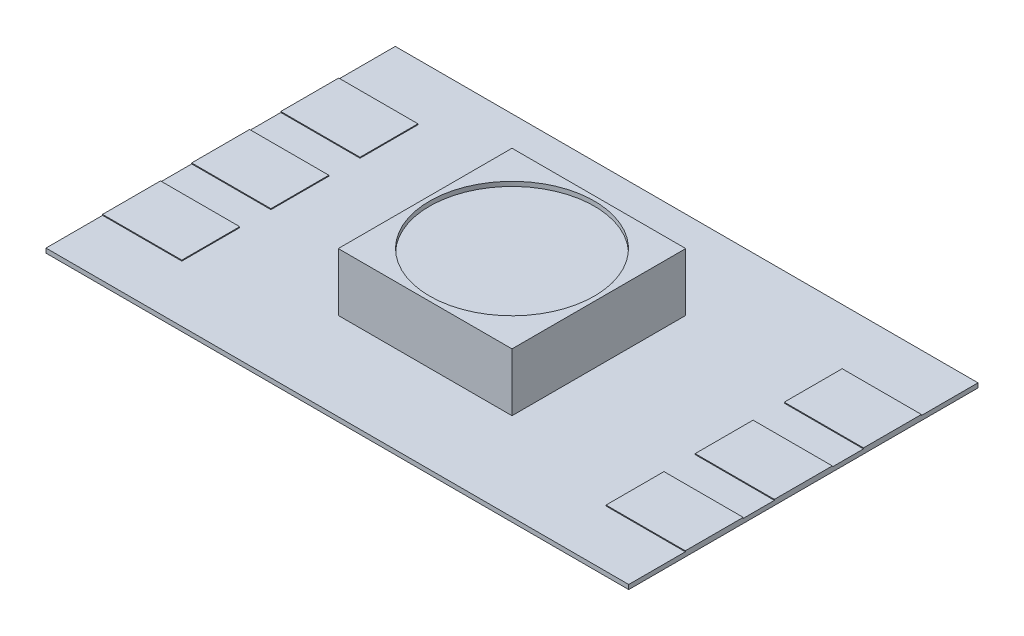
ISO-10303-21;
HEADER;
FILE_DESCRIPTION(('STEP AP214'),'2;1');
FILE_NAME('part.step','',(''),(''),'','','');
FILE_SCHEMA(('AUTOMOTIVE_DESIGN { 1 0 10303 214 1 1 1 1 }'));
ENDSEC;
DATA;
#1=APPLICATION_CONTEXT('core data for automotive mechanical design processes');
#2=APPLICATION_PROTOCOL_DEFINITION('international standard','automotive_design',2000,#1);
#3=PRODUCT_CONTEXT('',#1,'mechanical');
#4=PRODUCT('Part','Part','',(#3));
#5=PRODUCT_RELATED_PRODUCT_CATEGORY('part','',(#4));
#6=PRODUCT_DEFINITION_FORMATION('','',#4);
#7=PRODUCT_DEFINITION_CONTEXT('part definition',#1,'design');
#8=PRODUCT_DEFINITION('design','',#6,#7);
#9=PRODUCT_DEFINITION_SHAPE('','',#8);
#10=(LENGTH_UNIT() NAMED_UNIT(*) SI_UNIT(.MILLI.,.METRE.));
#11=(NAMED_UNIT(*) PLANE_ANGLE_UNIT() SI_UNIT($,.RADIAN.));
#12=(NAMED_UNIT(*) SI_UNIT($,.STERADIAN.) SOLID_ANGLE_UNIT());
#13=UNCERTAINTY_MEASURE_WITH_UNIT(LENGTH_MEASURE(1.E-05),#10,'distance_accuracy_value','');
#14=(GEOMETRIC_REPRESENTATION_CONTEXT(3) GLOBAL_UNCERTAINTY_ASSIGNED_CONTEXT((#13)) GLOBAL_UNIT_ASSIGNED_CONTEXT((#10,
#11,#12)) REPRESENTATION_CONTEXT('',''));
#15=CARTESIAN_POINT('',(0.,0.,0.));
#16=DIRECTION('',(0.,0.,1.));
#17=DIRECTION('',(1.,0.,0.));
#18=AXIS2_PLACEMENT_3D('',#15,#16,#17);
#19=CARTESIAN_POINT('',(0.,0.127,0.));
#20=DIRECTION('',(0.,1.,0.));
#21=DIRECTION('',(0.,0.,1.));
#22=AXIS2_PLACEMENT_3D('',#19,#20,#21);
#23=PLANE('',#22);
#24=DIRECTION('',(1.,0.,0.));
#25=VECTOR('',#24,1.);
#26=CARTESIAN_POINT('',(-2.4765,0.127,2.4765));
#27=LINE('',#26,#25);
#28=CARTESIAN_POINT('',(-2.4765,0.127,2.4765));
#29=VERTEX_POINT('',#28);
#30=CARTESIAN_POINT('',(2.4765,0.127,2.4765));
#31=VERTEX_POINT('',#30);
#32=EDGE_CURVE('E432',#29,#31,#27,.T.);
#33=ORIENTED_EDGE('',*,*,#32,.F.);
#34=DIRECTION('',(0.,0.,1.));
#35=VECTOR('',#34,1.);
#36=CARTESIAN_POINT('',(-2.4765,0.127,-2.4765));
#37=LINE('',#36,#35);
#38=CARTESIAN_POINT('',(-2.4765,0.127,-2.4765));
#39=VERTEX_POINT('',#38);
#40=EDGE_CURVE('E418',#39,#29,#37,.T.);
#41=ORIENTED_EDGE('',*,*,#40,.F.);
#42=DIRECTION('',(-1.,0.,0.));
#43=VECTOR('',#42,1.);
#44=CARTESIAN_POINT('',(-2.4765,0.127,-2.4765));
#45=LINE('',#44,#43);
#46=CARTESIAN_POINT('',(2.4765,0.127,-2.4765));
#47=VERTEX_POINT('',#46);
#48=EDGE_CURVE('E423',#47,#39,#45,.T.);
#49=ORIENTED_EDGE('',*,*,#48,.F.);
#50=DIRECTION('',(0.,0.,-1.));
#51=VECTOR('',#50,1.);
#52=CARTESIAN_POINT('',(2.4765,0.127,-2.4765));
#53=LINE('',#52,#51);
#54=EDGE_CURVE('E434',#31,#47,#53,.T.);
#55=ORIENTED_EDGE('',*,*,#54,.F.);
#56=EDGE_LOOP('',(#33,#41,#49,#55));
#57=FACE_BOUND('',#56,.T.);
#58=DIRECTION('',(0.,0.,1.));
#59=VECTOR('',#58,1.);
#60=CARTESIAN_POINT('',(6.0469898489771,0.127,-3.36550000000005));
#61=LINE('',#60,#59);
#62=CARTESIAN_POINT('',(6.0469898489771,0.127,-3.36550000000005));
#63=VERTEX_POINT('',#62);
#64=CARTESIAN_POINT('',(6.04698984897711,0.127,-1.71450000000005));
#65=VERTEX_POINT('',#64);
#66=EDGE_CURVE('E47',#63,#65,#61,.T.);
#67=ORIENTED_EDGE('',*,*,#66,.F.);
#68=DIRECTION('',(-1.,0.,0.));
#69=VECTOR('',#68,1.);
#70=CARTESIAN_POINT('',(8.30579999999996,0.127,-3.36550000000007));
#71=LINE('',#70,#69);
#72=CARTESIAN_POINT('',(8.30579999999996,0.127,-3.36550000000007));
#73=VERTEX_POINT('',#72);
#74=EDGE_CURVE('E878',#73,#63,#71,.T.);
#75=ORIENTED_EDGE('',*,*,#74,.F.);
#76=DIRECTION('',(0.,0.,-1.));
#77=VECTOR('',#76,1.);
#78=CARTESIAN_POINT('',(8.30580000000002,0.127,-4.97839999999999));
#79=LINE('',#78,#77);
#80=CARTESIAN_POINT('',(8.30580000000002,0.127,-4.97839999999999));
#81=VERTEX_POINT('',#80);
#82=EDGE_CURVE('E262',#73,#81,#79,.T.);
#83=ORIENTED_EDGE('',*,*,#82,.T.);
#84=DIRECTION('',(-1.,0.,0.));
#85=VECTOR('',#84,1.);
#86=CARTESIAN_POINT('',(-8.30579999999997,0.127,-4.97839999999999));
#87=LINE('',#86,#85);
#88=CARTESIAN_POINT('',(-8.30579999999997,0.127,-4.97839999999999));
#89=VERTEX_POINT('',#88);
#90=EDGE_CURVE('E457',#81,#89,#87,.T.);
#91=ORIENTED_EDGE('',*,*,#90,.T.);
#92=DIRECTION('',(0.,0.,1.));
#93=VECTOR('',#92,1.);
#94=CARTESIAN_POINT('',(-8.30579999999997,0.127,-4.97839999999999));
#95=LINE('',#94,#93);
#96=CARTESIAN_POINT('',(-8.30579999999997,0.127,-3.3655));
#97=VERTEX_POINT('',#96);
#98=EDGE_CURVE('E448',#89,#97,#95,.T.);
#99=ORIENTED_EDGE('',*,*,#98,.T.);
#100=DIRECTION('',(-1.,0.,0.));
#101=VECTOR('',#100,1.);
#102=CARTESIAN_POINT('',(-8.30579999999998,0.127,-3.3655));
#103=LINE('',#102,#101);
#104=CARTESIAN_POINT('',(-6.04698984897713,0.127,-3.3655));
#105=VERTEX_POINT('',#104);
#106=EDGE_CURVE('E363',#105,#97,#103,.T.);
#107=ORIENTED_EDGE('',*,*,#106,.F.);
#108=DIRECTION('',(0.,0.,-1.));
#109=VECTOR('',#108,1.);
#110=CARTESIAN_POINT('',(-6.04698984897713,0.127,-3.3655));
#111=LINE('',#110,#109);
#112=CARTESIAN_POINT('',(-6.04698984897713,0.127,-1.7145));
#113=VERTEX_POINT('',#112);
#114=EDGE_CURVE('E372',#113,#105,#111,.T.);
#115=ORIENTED_EDGE('',*,*,#114,.F.);
#116=DIRECTION('',(1.,0.,0.));
#117=VECTOR('',#116,1.);
#118=CARTESIAN_POINT('',(-8.30579999999998,0.127,-1.7145));
#119=LINE('',#118,#117);
#120=CARTESIAN_POINT('',(-8.30579999999998,0.127,-1.7145));
#121=VERTEX_POINT('',#120);
#122=EDGE_CURVE('E358',#121,#113,#119,.T.);
#123=ORIENTED_EDGE('',*,*,#122,.F.);
#124=CARTESIAN_POINT('',(-8.30579999999997,0.127,-0.8255));
#125=VERTEX_POINT('',#124);
#126=EDGE_CURVE('E451',#121,#125,#95,.T.);
#127=ORIENTED_EDGE('',*,*,#126,.T.);
#128=DIRECTION('',(-1.,0.,0.));
#129=VECTOR('',#128,1.);
#130=CARTESIAN_POINT('',(-8.30579999999997,0.127,-0.8255));
#131=LINE('',#130,#129);
#132=CARTESIAN_POINT('',(-6.04698984897712,0.127,-0.8255));
#133=VERTEX_POINT('',#132);
#134=EDGE_CURVE('E393',#133,#125,#131,.T.);
#135=ORIENTED_EDGE('',*,*,#134,.F.);
#136=DIRECTION('',(0.,0.,-1.));
#137=VECTOR('',#136,1.);
#138=CARTESIAN_POINT('',(-6.04698984897712,0.127,-0.8255));
#139=LINE('',#138,#137);
#140=CARTESIAN_POINT('',(-6.04698984897712,0.127,0.8255));
#141=VERTEX_POINT('',#140);
#142=EDGE_CURVE('E402',#141,#133,#139,.T.);
#143=ORIENTED_EDGE('',*,*,#142,.F.);
#144=DIRECTION('',(1.,0.,0.));
#145=VECTOR('',#144,1.);
#146=CARTESIAN_POINT('',(-8.30579999999997,0.127,0.8255));
#147=LINE('',#146,#145);
#148=CARTESIAN_POINT('',(-8.30579999999997,0.127,0.8255));
#149=VERTEX_POINT('',#148);
#150=EDGE_CURVE('E388',#149,#141,#147,.T.);
#151=ORIENTED_EDGE('',*,*,#150,.F.);
#152=CARTESIAN_POINT('',(-8.30579999999997,0.127,1.71450000000002));
#153=VERTEX_POINT('',#152);
#154=EDGE_CURVE('E453',#149,#153,#95,.T.);
#155=ORIENTED_EDGE('',*,*,#154,.T.);
#156=DIRECTION('',(-1.,0.,0.));
#157=VECTOR('',#156,1.);
#158=CARTESIAN_POINT('',(-8.30579999999998,0.127,1.71450000000002));
#159=LINE('',#158,#157);
#160=CARTESIAN_POINT('',(-6.04698984897713,0.127,1.71450000000002));
#161=VERTEX_POINT('',#160);
#162=EDGE_CURVE('E333',#161,#153,#159,.T.);
#163=ORIENTED_EDGE('',*,*,#162,.F.);
#164=DIRECTION('',(0.,0.,-1.));
#165=VECTOR('',#164,1.);
#166=CARTESIAN_POINT('',(-6.04698984897713,0.127,3.36550000000002));
#167=LINE('',#166,#165);
#168=CARTESIAN_POINT('',(-6.04698984897713,0.127,3.36550000000002));
#169=VERTEX_POINT('',#168);
#170=EDGE_CURVE('E342',#169,#161,#167,.T.);
#171=ORIENTED_EDGE('',*,*,#170,.F.);
#172=DIRECTION('',(1.,0.,0.));
#173=VECTOR('',#172,1.);
#174=CARTESIAN_POINT('',(-8.30579999999998,0.127,3.36550000000002));
#175=LINE('',#174,#173);
#176=CARTESIAN_POINT('',(-8.30579999999998,0.127,3.36550000000002));
#177=VERTEX_POINT('',#176);
#178=EDGE_CURVE('E328',#177,#169,#175,.T.);
#179=ORIENTED_EDGE('',*,*,#178,.F.);
#180=CARTESIAN_POINT('',(-8.30579999999997,0.127,4.97840000000001));
#181=VERTEX_POINT('',#180);
#182=EDGE_CURVE('E452',#177,#181,#95,.T.);
#183=ORIENTED_EDGE('',*,*,#182,.T.);
#184=DIRECTION('',(1.,0.,0.));
#185=VECTOR('',#184,1.);
#186=CARTESIAN_POINT('',(-8.30579999999997,0.127,4.97840000000001));
#187=LINE('',#186,#185);
#188=CARTESIAN_POINT('',(8.30580000000002,0.127,4.97840000000001));
#189=VERTEX_POINT('',#188);
#190=EDGE_CURVE('E450',#181,#189,#187,.T.);
#191=ORIENTED_EDGE('',*,*,#190,.T.);
#192=CARTESIAN_POINT('',(8.30580000000002,0.127,3.36549999999997));
#193=VERTEX_POINT('',#192);
#194=EDGE_CURVE('E455',#189,#193,#79,.T.);
#195=ORIENTED_EDGE('',*,*,#194,.T.);
#196=DIRECTION('',(1.,0.,0.));
#197=VECTOR('',#196,1.);
#198=CARTESIAN_POINT('',(8.30580000000001,0.127,3.36549999999995));
#199=LINE('',#198,#197);
#200=CARTESIAN_POINT('',(6.04698984897716,0.127,3.36549999999997));
#201=VERTEX_POINT('',#200);
#202=EDGE_CURVE('E298',#201,#193,#199,.T.);
#203=ORIENTED_EDGE('',*,*,#202,.F.);
#204=DIRECTION('',(0.,0.,1.));
#205=VECTOR('',#204,1.);
#206=CARTESIAN_POINT('',(6.04698984897716,0.127,3.36549999999997));
#207=LINE('',#206,#205);
#208=CARTESIAN_POINT('',(6.04698984897714,0.127,1.71449999999997));
#209=VERTEX_POINT('',#208);
#210=EDGE_CURVE('E303',#209,#201,#207,.T.);
#211=ORIENTED_EDGE('',*,*,#210,.F.);
#212=DIRECTION('',(-1.,0.,0.));
#213=VECTOR('',#212,1.);
#214=CARTESIAN_POINT('',(8.3058,0.127,1.71449999999995));
#215=LINE('',#214,#213);
#216=CARTESIAN_POINT('',(8.3058,0.127,1.71449999999995));
#217=VERTEX_POINT('',#216);
#218=EDGE_CURVE('E312',#217,#209,#215,.T.);
#219=ORIENTED_EDGE('',*,*,#218,.F.);
#220=CARTESIAN_POINT('',(8.30580000000002,0.127,0.825499999999949));
#221=VERTEX_POINT('',#220);
#222=EDGE_CURVE('E458',#217,#221,#79,.T.);
#223=ORIENTED_EDGE('',*,*,#222,.T.);
#224=DIRECTION('',(1.,0.,0.));
#225=VECTOR('',#224,1.);
#226=CARTESIAN_POINT('',(8.30579999999998,0.127,0.825499999999931));
#227=LINE('',#226,#225);
#228=CARTESIAN_POINT('',(6.04698984897713,0.127,0.825499999999949));
#229=VERTEX_POINT('',#228);
#230=EDGE_CURVE('E276',#229,#221,#227,.T.);
#231=ORIENTED_EDGE('',*,*,#230,.F.);
#232=DIRECTION('',(0.,0.,1.));
#233=VECTOR('',#232,1.);
#234=CARTESIAN_POINT('',(6.04698984897711,0.127,-0.82550000000005));
#235=LINE('',#234,#233);
#236=CARTESIAN_POINT('',(6.04698984897711,0.127,-0.82550000000005));
#237=VERTEX_POINT('',#236);
#238=EDGE_CURVE('E266',#237,#229,#235,.T.);
#239=ORIENTED_EDGE('',*,*,#238,.F.);
#240=DIRECTION('',(-1.,0.,0.));
#241=VECTOR('',#240,1.);
#242=CARTESIAN_POINT('',(8.30579999999997,0.127,-0.825500000000069));
#243=LINE('',#242,#241);
#244=CARTESIAN_POINT('',(8.30579999999997,0.127,-0.825500000000069));
#245=VERTEX_POINT('',#244);
#246=EDGE_CURVE('E263',#245,#237,#243,.T.);
#247=ORIENTED_EDGE('',*,*,#246,.F.);
#248=CARTESIAN_POINT('',(8.30580000000002,0.127,-1.71450000000005));
#249=VERTEX_POINT('',#248);
#250=EDGE_CURVE('E893',#245,#249,#79,.T.);
#251=ORIENTED_EDGE('',*,*,#250,.T.);
#252=DIRECTION('',(1.,0.,0.));
#253=VECTOR('',#252,1.);
#254=CARTESIAN_POINT('',(8.30579999999997,0.127,-1.71450000000007));
#255=LINE('',#254,#253);
#256=EDGE_CURVE('E52',#65,#249,#255,.T.);
#257=ORIENTED_EDGE('',*,*,#256,.F.);
#258=EDGE_LOOP('',(#67,#75,#83,#91,#99,#107,#115,#123,#127,#135,#143,#151,#155,#163,#171,#179,
#183,#191,#195,#203,#211,#219,#223,#231,#239,#247,#251,#257));
#259=FACE_BOUND('',#258,.T.);
#260=ADVANCED_FACE('F32',(#57,#259),#23,.T.);
#261=CARTESIAN_POINT('',(-8.30579999999997,0.127,-4.97839999999999));
#262=DIRECTION('',(1.,0.,0.));
#263=DIRECTION('',(0.,0.,-1.));
#264=AXIS2_PLACEMENT_3D('',#261,#262,#263);
#265=PLANE('',#264);
#266=DIRECTION('',(0.,0.,1.));
#267=VECTOR('',#266,1.);
#268=CARTESIAN_POINT('',(-8.30579999999997,0.,-4.97839999999999));
#269=LINE('',#268,#267);
#270=CARTESIAN_POINT('',(-8.30579999999997,0.,-4.97839999999999));
#271=VERTEX_POINT('',#270);
#272=CARTESIAN_POINT('',(-8.30579999999997,0.,4.97840000000001));
#273=VERTEX_POINT('',#272);
#274=EDGE_CURVE('E447',#271,#273,#269,.T.);
#275=ORIENTED_EDGE('',*,*,#274,.T.);
#276=DIRECTION('',(0.,-1.,0.));
#277=VECTOR('',#276,1.);
#278=CARTESIAN_POINT('',(-8.30579999999997,0.127,4.97840000000001));
#279=LINE('',#278,#277);
#280=EDGE_CURVE('E11',#181,#273,#279,.T.);
#281=ORIENTED_EDGE('',*,*,#280,.F.);
#282=ORIENTED_EDGE('',*,*,#182,.F.);
#283=DIRECTION('',(0.,-1.,0.));
#284=VECTOR('',#283,1.);
#285=CARTESIAN_POINT('',(-8.30579999999998,0.1524,3.36550000000002));
#286=LINE('',#285,#284);
#287=CARTESIAN_POINT('',(-8.30579999999998,0.1524,3.36550000000002));
#288=VERTEX_POINT('',#287);
#289=EDGE_CURVE('E339',#288,#177,#286,.T.);
#290=ORIENTED_EDGE('',*,*,#289,.F.);
#291=DIRECTION('',(0.,0.,1.));
#292=VECTOR('',#291,1.);
#293=CARTESIAN_POINT('',(-8.30579999999998,0.1524,3.36550000000002));
#294=LINE('',#293,#292);
#295=CARTESIAN_POINT('',(-8.30579999999998,0.1524,1.71450000000002));
#296=VERTEX_POINT('',#295);
#297=EDGE_CURVE('E337',#296,#288,#294,.T.);
#298=ORIENTED_EDGE('',*,*,#297,.F.);
#299=DIRECTION('',(0.,-1.,0.));
#300=VECTOR('',#299,1.);
#301=CARTESIAN_POINT('',(-8.30579999999998,0.1524,1.71450000000002));
#302=LINE('',#301,#300);
#303=EDGE_CURVE('E349',#296,#153,#302,.T.);
#304=ORIENTED_EDGE('',*,*,#303,.T.);
#305=ORIENTED_EDGE('',*,*,#154,.F.);
#306=DIRECTION('',(0.,-1.,0.));
#307=VECTOR('',#306,1.);
#308=CARTESIAN_POINT('',(-8.30579999999997,0.1524,0.8255));
#309=LINE('',#308,#307);
#310=CARTESIAN_POINT('',(-8.30579999999997,0.1524,0.8255));
#311=VERTEX_POINT('',#310);
#312=EDGE_CURVE('E415',#311,#149,#309,.T.);
#313=ORIENTED_EDGE('',*,*,#312,.F.);
#314=DIRECTION('',(0.,0.,1.));
#315=VECTOR('',#314,1.);
#316=CARTESIAN_POINT('',(-8.30579999999997,0.1524,-0.8255));
#317=LINE('',#316,#315);
#318=CARTESIAN_POINT('',(-8.30579999999997,0.1524,-0.8255));
#319=VERTEX_POINT('',#318);
#320=EDGE_CURVE('E389',#319,#311,#317,.T.);
#321=ORIENTED_EDGE('',*,*,#320,.F.);
#322=DIRECTION('',(0.,-1.,0.));
#323=VECTOR('',#322,1.);
#324=CARTESIAN_POINT('',(-8.30579999999997,0.1524,-0.8255));
#325=LINE('',#324,#323);
#326=EDGE_CURVE('E399',#319,#125,#325,.T.);
#327=ORIENTED_EDGE('',*,*,#326,.T.);
#328=ORIENTED_EDGE('',*,*,#126,.F.);
#329=DIRECTION('',(0.,-1.,0.));
#330=VECTOR('',#329,1.);
#331=CARTESIAN_POINT('',(-8.30579999999998,0.1524,-1.7145));
#332=LINE('',#331,#330);
#333=CARTESIAN_POINT('',(-8.30579999999998,0.1524,-1.7145));
#334=VERTEX_POINT('',#333);
#335=EDGE_CURVE('E385',#334,#121,#332,.T.);
#336=ORIENTED_EDGE('',*,*,#335,.F.);
#337=DIRECTION('',(0.,0.,1.));
#338=VECTOR('',#337,1.);
#339=CARTESIAN_POINT('',(-8.30579999999998,0.1524,-3.3655));
#340=LINE('',#339,#338);
#341=CARTESIAN_POINT('',(-8.30579999999998,0.1524,-3.3655));
#342=VERTEX_POINT('',#341);
#343=EDGE_CURVE('E359',#342,#334,#340,.T.);
#344=ORIENTED_EDGE('',*,*,#343,.F.);
#345=DIRECTION('',(0.,-1.,0.));
#346=VECTOR('',#345,1.);
#347=CARTESIAN_POINT('',(-8.30579999999998,0.1524,-3.3655));
#348=LINE('',#347,#346);
#349=EDGE_CURVE('E369',#342,#97,#348,.T.);
#350=ORIENTED_EDGE('',*,*,#349,.T.);
#351=ORIENTED_EDGE('',*,*,#98,.F.);
#352=DIRECTION('',(0.,-1.,0.));
#353=VECTOR('',#352,1.);
#354=CARTESIAN_POINT('',(-8.30579999999997,0.127,-4.97839999999999));
#355=LINE('',#354,#353);
#356=EDGE_CURVE('E460',#89,#271,#355,.T.);
#357=ORIENTED_EDGE('',*,*,#356,.T.);
#358=EDGE_LOOP('',(#275,#281,#282,#290,#298,#304,#305,#313,#321,#327,#328,#336,#344,#350,#351,#357));
#359=FACE_BOUND('',#358,.T.);
#360=ADVANCED_FACE('F34',(#359),#265,.F.);
#361=CARTESIAN_POINT('',(-8.30579999999997,0.127,4.97840000000001));
#362=DIRECTION('',(0.,0.,-1.));
#363=DIRECTION('',(-1.,0.,0.));
#364=AXIS2_PLACEMENT_3D('',#361,#362,#363);
#365=PLANE('',#364);
#366=DIRECTION('',(1.,0.,0.));
#367=VECTOR('',#366,1.);
#368=CARTESIAN_POINT('',(-8.30579999999997,0.,4.97840000000001));
#369=LINE('',#368,#367);
#370=CARTESIAN_POINT('',(8.30580000000002,0.,4.97840000000001));
#371=VERTEX_POINT('',#370);
#372=EDGE_CURVE('E463',#273,#371,#369,.T.);
#373=ORIENTED_EDGE('',*,*,#372,.T.);
#374=DIRECTION('',(0.,-1.,0.));
#375=VECTOR('',#374,1.);
#376=CARTESIAN_POINT('',(8.30580000000002,0.127,4.97840000000001));
#377=LINE('',#376,#375);
#378=EDGE_CURVE('E40',#189,#371,#377,.T.);
#379=ORIENTED_EDGE('',*,*,#378,.F.);
#380=ORIENTED_EDGE('',*,*,#190,.F.);
#381=ORIENTED_EDGE('',*,*,#280,.T.);
#382=EDGE_LOOP('',(#373,#379,#380,#381));
#383=FACE_BOUND('',#382,.T.);
#384=ADVANCED_FACE('F508',(#383),#365,.F.);
#385=CARTESIAN_POINT('',(8.30580000000002,0.127,-4.97839999999999));
#386=DIRECTION('',(-1.,0.,0.));
#387=DIRECTION('',(0.,0.,1.));
#388=AXIS2_PLACEMENT_3D('',#385,#386,#387);
#389=PLANE('',#388);
#390=DIRECTION('',(0.,0.,-1.));
#391=VECTOR('',#390,1.);
#392=CARTESIAN_POINT('',(8.30580000000002,0.,-4.97839999999999));
#393=LINE('',#392,#391);
#394=CARTESIAN_POINT('',(8.30580000000002,0.,-4.97839999999999));
#395=VERTEX_POINT('',#394);
#396=EDGE_CURVE('E465',#371,#395,#393,.T.);
#397=ORIENTED_EDGE('',*,*,#396,.T.);
#398=DIRECTION('',(0.,-1.,0.));
#399=VECTOR('',#398,1.);
#400=CARTESIAN_POINT('',(8.30580000000002,0.127,-4.97839999999999));
#401=LINE('',#400,#399);
#402=EDGE_CURVE('E471',#81,#395,#401,.T.);
#403=ORIENTED_EDGE('',*,*,#402,.F.);
#404=ORIENTED_EDGE('',*,*,#82,.F.);
#405=DIRECTION('',(0.,-1.,0.));
#406=VECTOR('',#405,1.);
#407=CARTESIAN_POINT('',(8.30579999999996,0.1524,-3.36550000000007));
#408=LINE('',#407,#406);
#409=CARTESIAN_POINT('',(8.30579999999996,0.1524,-3.36550000000007));
#410=VERTEX_POINT('',#409);
#411=EDGE_CURVE('E244',#410,#73,#408,.T.);
#412=ORIENTED_EDGE('',*,*,#411,.F.);
#413=DIRECTION('',(0.,0.,-1.));
#414=VECTOR('',#413,1.);
#415=CARTESIAN_POINT('',(8.30579999999996,0.1524,-3.36550000000007));
#416=LINE('',#415,#414);
#417=CARTESIAN_POINT('',(8.30579999999997,0.1524,-1.71450000000007));
#418=VERTEX_POINT('',#417);
#419=EDGE_CURVE('E250',#418,#410,#416,.T.);
#420=ORIENTED_EDGE('',*,*,#419,.F.);
#421=DIRECTION('',(0.,-1.,0.));
#422=VECTOR('',#421,1.);
#423=CARTESIAN_POINT('',(8.30579999999997,0.1524,-1.71450000000007));
#424=LINE('',#423,#422);
#425=EDGE_CURVE('E886',#418,#249,#424,.T.);
#426=ORIENTED_EDGE('',*,*,#425,.T.);
#427=ORIENTED_EDGE('',*,*,#250,.F.);
#428=DIRECTION('',(0.,-1.,0.));
#429=VECTOR('',#428,1.);
#430=CARTESIAN_POINT('',(8.30579999999997,0.1524,-0.825500000000069));
#431=LINE('',#430,#429);
#432=CARTESIAN_POINT('',(8.30579999999997,0.1524,-0.825500000000069));
#433=VERTEX_POINT('',#432);
#434=EDGE_CURVE('E281',#433,#245,#431,.T.);
#435=ORIENTED_EDGE('',*,*,#434,.F.);
#436=DIRECTION('',(0.,0.,-1.));
#437=VECTOR('',#436,1.);
#438=CARTESIAN_POINT('',(8.30579999999997,0.1524,-0.825500000000069));
#439=LINE('',#438,#437);
#440=CARTESIAN_POINT('',(8.30579999999998,0.1524,0.825499999999931));
#441=VERTEX_POINT('',#440);
#442=EDGE_CURVE('E280',#441,#433,#439,.T.);
#443=ORIENTED_EDGE('',*,*,#442,.F.);
#444=DIRECTION('',(0.,-1.,0.));
#445=VECTOR('',#444,1.);
#446=CARTESIAN_POINT('',(8.30579999999998,0.1524,0.825499999999931));
#447=LINE('',#446,#445);
#448=EDGE_CURVE('E289',#441,#221,#447,.T.);
#449=ORIENTED_EDGE('',*,*,#448,.T.);
#450=ORIENTED_EDGE('',*,*,#222,.F.);
#451=DIRECTION('',(0.,-1.,0.));
#452=VECTOR('',#451,1.);
#453=CARTESIAN_POINT('',(8.3058,0.1524,1.71449999999995));
#454=LINE('',#453,#452);
#455=CARTESIAN_POINT('',(8.3058,0.1524,1.71449999999995));
#456=VERTEX_POINT('',#455);
#457=EDGE_CURVE('E322',#456,#217,#454,.T.);
#458=ORIENTED_EDGE('',*,*,#457,.F.);
#459=DIRECTION('',(0.,0.,-1.));
#460=VECTOR('',#459,1.);
#461=CARTESIAN_POINT('',(8.30580000000001,0.1524,3.36549999999995));
#462=LINE('',#461,#460);
#463=CARTESIAN_POINT('',(8.30580000000001,0.1524,3.36549999999995));
#464=VERTEX_POINT('',#463);
#465=EDGE_CURVE('E302',#464,#456,#462,.T.);
#466=ORIENTED_EDGE('',*,*,#465,.F.);
#467=DIRECTION('',(0.,-1.,0.));
#468=VECTOR('',#467,1.);
#469=CARTESIAN_POINT('',(8.30580000000001,0.1524,3.36549999999995));
#470=LINE('',#469,#468);
#471=EDGE_CURVE('E325',#464,#193,#470,.T.);
#472=ORIENTED_EDGE('',*,*,#471,.T.);
#473=ORIENTED_EDGE('',*,*,#194,.F.);
#474=ORIENTED_EDGE('',*,*,#378,.T.);
#475=EDGE_LOOP('',(#397,#403,#404,#412,#420,#426,#427,#435,#443,#449,#450,#458,#466,#472,#473,#474));
#476=FACE_BOUND('',#475,.T.);
#477=ADVANCED_FACE('F260',(#476),#389,.F.);
#478=CARTESIAN_POINT('',(-8.30579999999997,0.127,-4.97839999999999));
#479=DIRECTION('',(0.,0.,1.));
#480=DIRECTION('',(1.,0.,0.));
#481=AXIS2_PLACEMENT_3D('',#478,#479,#480);
#482=PLANE('',#481);
#483=DIRECTION('',(-1.,0.,0.));
#484=VECTOR('',#483,1.);
#485=CARTESIAN_POINT('',(-8.30579999999997,0.,-4.97839999999999));
#486=LINE('',#485,#484);
#487=EDGE_CURVE('E467',#395,#271,#486,.T.);
#488=ORIENTED_EDGE('',*,*,#487,.T.);
#489=ORIENTED_EDGE('',*,*,#356,.F.);
#490=ORIENTED_EDGE('',*,*,#90,.F.);
#491=ORIENTED_EDGE('',*,*,#402,.T.);
#492=EDGE_LOOP('',(#488,#489,#490,#491));
#493=FACE_BOUND('',#492,.T.);
#494=ADVANCED_FACE('F485',(#493),#482,.F.);
#495=CARTESIAN_POINT('',(0.,0.,0.));
#496=DIRECTION('',(0.,1.,0.));
#497=DIRECTION('',(0.,0.,1.));
#498=AXIS2_PLACEMENT_3D('',#495,#496,#497);
#499=PLANE('',#498);
#500=ORIENTED_EDGE('',*,*,#274,.F.);
#501=ORIENTED_EDGE('',*,*,#487,.F.);
#502=ORIENTED_EDGE('',*,*,#396,.F.);
#503=ORIENTED_EDGE('',*,*,#372,.F.);
#504=EDGE_LOOP('',(#500,#501,#502,#503));
#505=FACE_BOUND('',#504,.T.);
#506=ADVANCED_FACE('F482',(#505),#499,.F.);
#507=CARTESIAN_POINT('',(-2.4765,1.778,-2.4765));
#508=DIRECTION('',(1.,0.,0.));
#509=DIRECTION('',(0.,0.,-1.));
#510=AXIS2_PLACEMENT_3D('',#507,#508,#509);
#511=PLANE('',#510);
#512=ORIENTED_EDGE('',*,*,#40,.T.);
#513=DIRECTION('',(0.,-1.,0.));
#514=VECTOR('',#513,1.);
#515=CARTESIAN_POINT('',(-2.4765,1.778,2.4765));
#516=LINE('',#515,#514);
#517=CARTESIAN_POINT('',(-2.4765,1.778,2.4765));
#518=VERTEX_POINT('',#517);
#519=EDGE_CURVE('E445',#518,#29,#516,.T.);
#520=ORIENTED_EDGE('',*,*,#519,.F.);
#521=DIRECTION('',(0.,0.,1.));
#522=VECTOR('',#521,1.);
#523=CARTESIAN_POINT('',(-2.4765,1.778,-2.4765));
#524=LINE('',#523,#522);
#525=CARTESIAN_POINT('',(-2.4765,1.778,-2.4765));
#526=VERTEX_POINT('',#525);
#527=EDGE_CURVE('E419',#526,#518,#524,.T.);
#528=ORIENTED_EDGE('',*,*,#527,.F.);
#529=DIRECTION('',(0.,-1.,0.));
#530=VECTOR('',#529,1.);
#531=CARTESIAN_POINT('',(-2.4765,1.778,-2.4765));
#532=LINE('',#531,#530);
#533=EDGE_CURVE('E429',#526,#39,#532,.T.);
#534=ORIENTED_EDGE('',*,*,#533,.T.);
#535=EDGE_LOOP('',(#512,#520,#528,#534));
#536=FACE_BOUND('',#535,.T.);
#537=ADVANCED_FACE('F523',(#536),#511,.F.);
#538=CARTESIAN_POINT('',(-2.4765,1.778,2.4765));
#539=DIRECTION('',(0.,0.,-1.));
#540=DIRECTION('',(-1.,0.,0.));
#541=AXIS2_PLACEMENT_3D('',#538,#539,#540);
#542=PLANE('',#541);
#543=ORIENTED_EDGE('',*,*,#32,.T.);
#544=DIRECTION('',(0.,-1.,0.));
#545=VECTOR('',#544,1.);
#546=CARTESIAN_POINT('',(2.4765,1.778,2.4765));
#547=LINE('',#546,#545);
#548=CARTESIAN_POINT('',(2.4765,1.778,2.4765));
#549=VERTEX_POINT('',#548);
#550=EDGE_CURVE('E442',#549,#31,#547,.T.);
#551=ORIENTED_EDGE('',*,*,#550,.F.);
#552=DIRECTION('',(1.,0.,0.));
#553=VECTOR('',#552,1.);
#554=CARTESIAN_POINT('',(-2.4765,1.778,2.4765));
#555=LINE('',#554,#553);
#556=EDGE_CURVE('E422',#518,#549,#555,.T.);
#557=ORIENTED_EDGE('',*,*,#556,.F.);
#558=ORIENTED_EDGE('',*,*,#519,.T.);
#559=EDGE_LOOP('',(#543,#551,#557,#558));
#560=FACE_BOUND('',#559,.T.);
#561=ADVANCED_FACE('F542',(#560),#542,.F.);
#562=CARTESIAN_POINT('',(2.4765,1.778,-2.4765));
#563=DIRECTION('',(-1.,0.,0.));
#564=DIRECTION('',(0.,0.,1.));
#565=AXIS2_PLACEMENT_3D('',#562,#563,#564);
#566=PLANE('',#565);
#567=ORIENTED_EDGE('',*,*,#54,.T.);
#568=DIRECTION('',(0.,-1.,0.));
#569=VECTOR('',#568,1.);
#570=CARTESIAN_POINT('',(2.4765,1.778,-2.4765));
#571=LINE('',#570,#569);
#572=CARTESIAN_POINT('',(2.4765,1.778,-2.4765));
#573=VERTEX_POINT('',#572);
#574=EDGE_CURVE('E440',#573,#47,#571,.T.);
#575=ORIENTED_EDGE('',*,*,#574,.F.);
#576=DIRECTION('',(0.,0.,-1.));
#577=VECTOR('',#576,1.);
#578=CARTESIAN_POINT('',(2.4765,1.778,-2.4765));
#579=LINE('',#578,#577);
#580=EDGE_CURVE('E425',#549,#573,#579,.T.);
#581=ORIENTED_EDGE('',*,*,#580,.F.);
#582=ORIENTED_EDGE('',*,*,#550,.T.);
#583=EDGE_LOOP('',(#567,#575,#581,#582));
#584=FACE_BOUND('',#583,.T.);
#585=ADVANCED_FACE('F549',(#584),#566,.F.);
#586=CARTESIAN_POINT('',(-2.4765,1.778,-2.4765));
#587=DIRECTION('',(0.,0.,1.));
#588=DIRECTION('',(1.,0.,0.));
#589=AXIS2_PLACEMENT_3D('',#586,#587,#588);
#590=PLANE('',#589);
#591=ORIENTED_EDGE('',*,*,#48,.T.);
#592=ORIENTED_EDGE('',*,*,#533,.F.);
#593=DIRECTION('',(-1.,0.,0.));
#594=VECTOR('',#593,1.);
#595=CARTESIAN_POINT('',(-2.4765,1.778,-2.4765));
#596=LINE('',#595,#594);
#597=EDGE_CURVE('E427',#573,#526,#596,.T.);
#598=ORIENTED_EDGE('',*,*,#597,.F.);
#599=ORIENTED_EDGE('',*,*,#574,.T.);
#600=EDGE_LOOP('',(#591,#592,#598,#599));
#601=FACE_BOUND('',#600,.T.);
#602=ADVANCED_FACE('F556',(#601),#590,.F.);
#603=CARTESIAN_POINT('',(0.,1.778,0.));
#604=DIRECTION('',(0.,1.,0.));
#605=DIRECTION('',(0.,0.,1.));
#606=AXIS2_PLACEMENT_3D('',#603,#604,#605);
#607=PLANE('',#606);
#608=CARTESIAN_POINT('',(0.,1.778,0.));
#609=DIRECTION('',(0.,1.,0.));
#610=DIRECTION('',(0.,0.,1.));
#611=AXIS2_PLACEMENT_3D('',#608,#609,#610);
#612=CIRCLE('',#611,2.34834557241832);
#613=CARTESIAN_POINT('',(0.,1.778,2.34834557241832));
#614=VERTEX_POINT('',#613);
#615=EDGE_CURVE('E879',#614,#614,#612,.T.);
#616=ORIENTED_EDGE('',*,*,#615,.F.);
#617=EDGE_LOOP('',(#616));
#618=FACE_BOUND('',#617,.T.);
#619=ORIENTED_EDGE('',*,*,#527,.T.);
#620=ORIENTED_EDGE('',*,*,#556,.T.);
#621=ORIENTED_EDGE('',*,*,#580,.T.);
#622=ORIENTED_EDGE('',*,*,#597,.T.);
#623=EDGE_LOOP('',(#619,#620,#621,#622));
#624=FACE_BOUND('',#623,.T.);
#625=ADVANCED_FACE('F564',(#618,#624),#607,.T.);
#626=CARTESIAN_POINT('',(-8.30579999999997,0.1524,0.8255));
#627=DIRECTION('',(0.,0.,-1.));
#628=DIRECTION('',(-1.,0.,0.));
#629=AXIS2_PLACEMENT_3D('',#626,#627,#628);
#630=PLANE('',#629);
#631=ORIENTED_EDGE('',*,*,#150,.T.);
#632=DIRECTION('',(0.,-1.,0.));
#633=VECTOR('',#632,1.);
#634=CARTESIAN_POINT('',(-6.04698984897712,0.1524,0.8255));
#635=LINE('',#634,#633);
#636=CARTESIAN_POINT('',(-6.04698984897712,0.1524,0.8255));
#637=VERTEX_POINT('',#636);
#638=EDGE_CURVE('E412',#637,#141,#635,.T.);
#639=ORIENTED_EDGE('',*,*,#638,.F.);
#640=DIRECTION('',(1.,0.,0.));
#641=VECTOR('',#640,1.);
#642=CARTESIAN_POINT('',(-8.30579999999997,0.1524,0.8255));
#643=LINE('',#642,#641);
#644=EDGE_CURVE('E392',#311,#637,#643,.T.);
#645=ORIENTED_EDGE('',*,*,#644,.F.);
#646=ORIENTED_EDGE('',*,*,#312,.T.);
#647=EDGE_LOOP('',(#631,#639,#645,#646));
#648=FACE_BOUND('',#647,.T.);
#649=ADVANCED_FACE('F572',(#648),#630,.F.);
#650=CARTESIAN_POINT('',(-6.04698984897712,0.1524,-0.8255));
#651=DIRECTION('',(-1.,0.,0.));
#652=DIRECTION('',(0.,0.,1.));
#653=AXIS2_PLACEMENT_3D('',#650,#651,#652);
#654=PLANE('',#653);
#655=ORIENTED_EDGE('',*,*,#142,.T.);
#656=DIRECTION('',(0.,-1.,0.));
#657=VECTOR('',#656,1.);
#658=CARTESIAN_POINT('',(-6.04698984897712,0.1524,-0.8255));
#659=LINE('',#658,#657);
#660=CARTESIAN_POINT('',(-6.04698984897712,0.1524,-0.8255));
#661=VERTEX_POINT('',#660);
#662=EDGE_CURVE('E409',#661,#133,#659,.T.);
#663=ORIENTED_EDGE('',*,*,#662,.F.);
#664=DIRECTION('',(0.,0.,-1.));
#665=VECTOR('',#664,1.);
#666=CARTESIAN_POINT('',(-6.04698984897712,0.1524,-0.8255));
#667=LINE('',#666,#665);
#668=EDGE_CURVE('E395',#637,#661,#667,.T.);
#669=ORIENTED_EDGE('',*,*,#668,.F.);
#670=ORIENTED_EDGE('',*,*,#638,.T.);
#671=EDGE_LOOP('',(#655,#663,#669,#670));
#672=FACE_BOUND('',#671,.T.);
#673=ADVANCED_FACE('F582',(#672),#654,.F.);
#674=CARTESIAN_POINT('',(-8.30579999999997,0.1524,-0.8255));
#675=DIRECTION('',(0.,0.,1.));
#676=DIRECTION('',(1.,0.,0.));
#677=AXIS2_PLACEMENT_3D('',#674,#675,#676);
#678=PLANE('',#677);
#679=ORIENTED_EDGE('',*,*,#134,.T.);
#680=ORIENTED_EDGE('',*,*,#326,.F.);
#681=DIRECTION('',(-1.,0.,0.));
#682=VECTOR('',#681,1.);
#683=CARTESIAN_POINT('',(-8.30579999999997,0.1524,-0.8255));
#684=LINE('',#683,#682);
#685=EDGE_CURVE('E397',#661,#319,#684,.T.);
#686=ORIENTED_EDGE('',*,*,#685,.F.);
#687=ORIENTED_EDGE('',*,*,#662,.T.);
#688=EDGE_LOOP('',(#679,#680,#686,#687));
#689=FACE_BOUND('',#688,.T.);
#690=ADVANCED_FACE('F590',(#689),#678,.F.);
#691=CARTESIAN_POINT('',(0.,0.1524,0.));
#692=DIRECTION('',(0.,1.,0.));
#693=DIRECTION('',(0.,0.,1.));
#694=AXIS2_PLACEMENT_3D('',#691,#692,#693);
#695=PLANE('',#694);
#696=ORIENTED_EDGE('',*,*,#320,.T.);
#697=ORIENTED_EDGE('',*,*,#644,.T.);
#698=ORIENTED_EDGE('',*,*,#668,.T.);
#699=ORIENTED_EDGE('',*,*,#685,.T.);
#700=EDGE_LOOP('',(#696,#697,#698,#699));
#701=FACE_BOUND('',#700,.T.);
#702=ADVANCED_FACE('F598',(#701),#695,.T.);
#703=CARTESIAN_POINT('',(-8.30579999999998,0.1524,-1.7145));
#704=DIRECTION('',(0.,0.,-1.));
#705=DIRECTION('',(-1.,0.,0.));
#706=AXIS2_PLACEMENT_3D('',#703,#704,#705);
#707=PLANE('',#706);
#708=ORIENTED_EDGE('',*,*,#122,.T.);
#709=DIRECTION('',(0.,-1.,0.));
#710=VECTOR('',#709,1.);
#711=CARTESIAN_POINT('',(-6.04698984897713,0.1524,-1.7145));
#712=LINE('',#711,#710);
#713=CARTESIAN_POINT('',(-6.04698984897713,0.1524,-1.7145));
#714=VERTEX_POINT('',#713);
#715=EDGE_CURVE('E382',#714,#113,#712,.T.);
#716=ORIENTED_EDGE('',*,*,#715,.F.);
#717=DIRECTION('',(1.,0.,0.));
#718=VECTOR('',#717,1.);
#719=CARTESIAN_POINT('',(-8.30579999999998,0.1524,-1.7145));
#720=LINE('',#719,#718);
#721=EDGE_CURVE('E362',#334,#714,#720,.T.);
#722=ORIENTED_EDGE('',*,*,#721,.F.);
#723=ORIENTED_EDGE('',*,*,#335,.T.);
#724=EDGE_LOOP('',(#708,#716,#722,#723));
#725=FACE_BOUND('',#724,.T.);
#726=ADVANCED_FACE('F502',(#725),#707,.F.);
#727=CARTESIAN_POINT('',(-6.04698984897713,0.1524,-3.3655));
#728=DIRECTION('',(-1.,0.,0.));
#729=DIRECTION('',(0.,0.,1.));
#730=AXIS2_PLACEMENT_3D('',#727,#728,#729);
#731=PLANE('',#730);
#732=ORIENTED_EDGE('',*,*,#114,.T.);
#733=DIRECTION('',(0.,-1.,0.));
#734=VECTOR('',#733,1.);
#735=CARTESIAN_POINT('',(-6.04698984897713,0.1524,-3.3655));
#736=LINE('',#735,#734);
#737=CARTESIAN_POINT('',(-6.04698984897713,0.1524,-3.3655));
#738=VERTEX_POINT('',#737);
#739=EDGE_CURVE('E379',#738,#105,#736,.T.);
#740=ORIENTED_EDGE('',*,*,#739,.F.);
#741=DIRECTION('',(0.,0.,-1.));
#742=VECTOR('',#741,1.);
#743=CARTESIAN_POINT('',(-6.04698984897713,0.1524,-3.3655));
#744=LINE('',#743,#742);
#745=EDGE_CURVE('E365',#714,#738,#744,.T.);
#746=ORIENTED_EDGE('',*,*,#745,.F.);
#747=ORIENTED_EDGE('',*,*,#715,.T.);
#748=EDGE_LOOP('',(#732,#740,#746,#747));
#749=FACE_BOUND('',#748,.T.);
#750=ADVANCED_FACE('F498',(#749),#731,.F.);
#751=CARTESIAN_POINT('',(-8.30579999999998,0.1524,-3.3655));
#752=DIRECTION('',(0.,0.,1.));
#753=DIRECTION('',(1.,0.,0.));
#754=AXIS2_PLACEMENT_3D('',#751,#752,#753);
#755=PLANE('',#754);
#756=ORIENTED_EDGE('',*,*,#106,.T.);
#757=ORIENTED_EDGE('',*,*,#349,.F.);
#758=DIRECTION('',(-1.,0.,0.));
#759=VECTOR('',#758,1.);
#760=CARTESIAN_POINT('',(-8.30579999999998,0.1524,-3.3655));
#761=LINE('',#760,#759);
#762=EDGE_CURVE('E367',#738,#342,#761,.T.);
#763=ORIENTED_EDGE('',*,*,#762,.F.);
#764=ORIENTED_EDGE('',*,*,#739,.T.);
#765=EDGE_LOOP('',(#756,#757,#763,#764));
#766=FACE_BOUND('',#765,.T.);
#767=ADVANCED_FACE('F493',(#766),#755,.F.);
#768=CARTESIAN_POINT('',(0.,0.1524,0.));
#769=DIRECTION('',(0.,1.,0.));
#770=DIRECTION('',(0.,0.,1.));
#771=AXIS2_PLACEMENT_3D('',#768,#769,#770);
#772=PLANE('',#771);
#773=ORIENTED_EDGE('',*,*,#343,.T.);
#774=ORIENTED_EDGE('',*,*,#721,.T.);
#775=ORIENTED_EDGE('',*,*,#745,.T.);
#776=ORIENTED_EDGE('',*,*,#762,.T.);
#777=EDGE_LOOP('',(#773,#774,#775,#776));
#778=FACE_BOUND('',#777,.T.);
#779=ADVANCED_FACE('F625',(#778),#772,.T.);
#780=CARTESIAN_POINT('',(-8.30579999999998,0.1524,3.36550000000002));
#781=DIRECTION('',(0.,0.,-1.));
#782=DIRECTION('',(-1.,0.,0.));
#783=AXIS2_PLACEMENT_3D('',#780,#781,#782);
#784=PLANE('',#783);
#785=ORIENTED_EDGE('',*,*,#178,.T.);
#786=DIRECTION('',(0.,-1.,0.));
#787=VECTOR('',#786,1.);
#788=CARTESIAN_POINT('',(-6.04698984897713,0.1524,3.36550000000002));
#789=LINE('',#788,#787);
#790=CARTESIAN_POINT('',(-6.04698984897713,0.1524,3.36550000000002));
#791=VERTEX_POINT('',#790);
#792=EDGE_CURVE('E355',#791,#169,#789,.T.);
#793=ORIENTED_EDGE('',*,*,#792,.F.);
#794=DIRECTION('',(1.,0.,0.));
#795=VECTOR('',#794,1.);
#796=CARTESIAN_POINT('',(-8.30579999999998,0.1524,3.36550000000002));
#797=LINE('',#796,#795);
#798=EDGE_CURVE('E329',#288,#791,#797,.T.);
#799=ORIENTED_EDGE('',*,*,#798,.F.);
#800=ORIENTED_EDGE('',*,*,#289,.T.);
#801=EDGE_LOOP('',(#785,#793,#799,#800));
#802=FACE_BOUND('',#801,.T.);
#803=ADVANCED_FACE('F632',(#802),#784,.F.);
#804=CARTESIAN_POINT('',(-6.04698984897713,0.1524,3.36550000000002));
#805=DIRECTION('',(-1.,0.,0.));
#806=DIRECTION('',(0.,0.,1.));
#807=AXIS2_PLACEMENT_3D('',#804,#805,#806);
#808=PLANE('',#807);
#809=ORIENTED_EDGE('',*,*,#170,.T.);
#810=DIRECTION('',(0.,-1.,0.));
#811=VECTOR('',#810,1.);
#812=CARTESIAN_POINT('',(-6.04698984897713,0.1524,1.71450000000002));
#813=LINE('',#812,#811);
#814=CARTESIAN_POINT('',(-6.04698984897713,0.1524,1.71450000000002));
#815=VERTEX_POINT('',#814);
#816=EDGE_CURVE('E352',#815,#161,#813,.T.);
#817=ORIENTED_EDGE('',*,*,#816,.F.);
#818=DIRECTION('',(0.,0.,-1.));
#819=VECTOR('',#818,1.);
#820=CARTESIAN_POINT('',(-6.04698984897713,0.1524,3.36550000000002));
#821=LINE('',#820,#819);
#822=EDGE_CURVE('E332',#791,#815,#821,.T.);
#823=ORIENTED_EDGE('',*,*,#822,.F.);
#824=ORIENTED_EDGE('',*,*,#792,.T.);
#825=EDGE_LOOP('',(#809,#817,#823,#824));
#826=FACE_BOUND('',#825,.T.);
#827=ADVANCED_FACE('F640',(#826),#808,.F.);
#828=CARTESIAN_POINT('',(-8.30579999999998,0.1524,1.71450000000002));
#829=DIRECTION('',(0.,0.,1.));
#830=DIRECTION('',(1.,0.,0.));
#831=AXIS2_PLACEMENT_3D('',#828,#829,#830);
#832=PLANE('',#831);
#833=ORIENTED_EDGE('',*,*,#162,.T.);
#834=ORIENTED_EDGE('',*,*,#303,.F.);
#835=DIRECTION('',(-1.,0.,0.));
#836=VECTOR('',#835,1.);
#837=CARTESIAN_POINT('',(-8.30579999999998,0.1524,1.71450000000002));
#838=LINE('',#837,#836);
#839=EDGE_CURVE('E335',#815,#296,#838,.T.);
#840=ORIENTED_EDGE('',*,*,#839,.F.);
#841=ORIENTED_EDGE('',*,*,#816,.T.);
#842=EDGE_LOOP('',(#833,#834,#840,#841));
#843=FACE_BOUND('',#842,.T.);
#844=ADVANCED_FACE('F648',(#843),#832,.F.);
#845=CARTESIAN_POINT('',(0.,0.1524,0.));
#846=DIRECTION('',(0.,1.,0.));
#847=DIRECTION('',(0.,0.,1.));
#848=AXIS2_PLACEMENT_3D('',#845,#846,#847);
#849=PLANE('',#848);
#850=ORIENTED_EDGE('',*,*,#798,.T.);
#851=ORIENTED_EDGE('',*,*,#822,.T.);
#852=ORIENTED_EDGE('',*,*,#839,.T.);
#853=ORIENTED_EDGE('',*,*,#297,.T.);
#854=EDGE_LOOP('',(#850,#851,#852,#853));
#855=FACE_BOUND('',#854,.T.);
#856=ADVANCED_FACE('F656',(#855),#849,.T.);
#857=CARTESIAN_POINT('',(8.30580000000001,0.1524,3.36549999999995));
#858=DIRECTION('',(0.,0.,-1.));
#859=DIRECTION('',(-1.,0.,0.));
#860=AXIS2_PLACEMENT_3D('',#857,#858,#859);
#861=PLANE('',#860);
#862=ORIENTED_EDGE('',*,*,#202,.T.);
#863=ORIENTED_EDGE('',*,*,#471,.F.);
#864=DIRECTION('',(1.,0.,0.));
#865=VECTOR('',#864,1.);
#866=CARTESIAN_POINT('',(8.30580000000001,0.1524,3.36549999999995));
#867=LINE('',#866,#865);
#868=CARTESIAN_POINT('',(6.04698984897716,0.1524,3.36549999999997));
#869=VERTEX_POINT('',#868);
#870=EDGE_CURVE('E299',#869,#464,#867,.T.);
#871=ORIENTED_EDGE('',*,*,#870,.F.);
#872=DIRECTION('',(0.,-1.,0.));
#873=VECTOR('',#872,1.);
#874=CARTESIAN_POINT('',(6.04698984897716,0.1524,3.36549999999997));
#875=LINE('',#874,#873);
#876=EDGE_CURVE('E309',#869,#201,#875,.T.);
#877=ORIENTED_EDGE('',*,*,#876,.T.);
#878=EDGE_LOOP('',(#862,#863,#871,#877));
#879=FACE_BOUND('',#878,.T.);
#880=ADVANCED_FACE('F664',(#879),#861,.F.);
#881=CARTESIAN_POINT('',(8.3058,0.1524,1.71449999999995));
#882=DIRECTION('',(0.,0.,1.));
#883=DIRECTION('',(1.,0.,0.));
#884=AXIS2_PLACEMENT_3D('',#881,#882,#883);
#885=PLANE('',#884);
#886=ORIENTED_EDGE('',*,*,#218,.T.);
#887=DIRECTION('',(0.,-1.,0.));
#888=VECTOR('',#887,1.);
#889=CARTESIAN_POINT('',(6.04698984897714,0.1524,1.71449999999997));
#890=LINE('',#889,#888);
#891=CARTESIAN_POINT('',(6.04698984897714,0.1524,1.71449999999997));
#892=VERTEX_POINT('',#891);
#893=EDGE_CURVE('E319',#892,#209,#890,.T.);
#894=ORIENTED_EDGE('',*,*,#893,.F.);
#895=DIRECTION('',(-1.,0.,0.));
#896=VECTOR('',#895,1.);
#897=CARTESIAN_POINT('',(8.3058,0.1524,1.71449999999995));
#898=LINE('',#897,#896);
#899=EDGE_CURVE('E305',#456,#892,#898,.T.);
#900=ORIENTED_EDGE('',*,*,#899,.F.);
#901=ORIENTED_EDGE('',*,*,#457,.T.);
#902=EDGE_LOOP('',(#886,#894,#900,#901));
#903=FACE_BOUND('',#902,.T.);
#904=ADVANCED_FACE('F672',(#903),#885,.F.);
#905=CARTESIAN_POINT('',(6.04698984897716,0.1524,3.36549999999997));
#906=DIRECTION('',(1.,0.,0.));
#907=DIRECTION('',(0.,0.,-1.));
#908=AXIS2_PLACEMENT_3D('',#905,#906,#907);
#909=PLANE('',#908);
#910=ORIENTED_EDGE('',*,*,#210,.T.);
#911=ORIENTED_EDGE('',*,*,#876,.F.);
#912=DIRECTION('',(0.,0.,1.));
#913=VECTOR('',#912,1.);
#914=CARTESIAN_POINT('',(6.04698984897716,0.1524,3.36549999999997));
#915=LINE('',#914,#913);
#916=EDGE_CURVE('E307',#892,#869,#915,.T.);
#917=ORIENTED_EDGE('',*,*,#916,.F.);
#918=ORIENTED_EDGE('',*,*,#893,.T.);
#919=EDGE_LOOP('',(#910,#911,#917,#918));
#920=FACE_BOUND('',#919,.T.);
#921=ADVANCED_FACE('F680',(#920),#909,.F.);
#922=CARTESIAN_POINT('',(0.,0.1524,0.));
#923=DIRECTION('',(0.,-1.,0.));
#924=DIRECTION('',(0.,0.,-1.));
#925=AXIS2_PLACEMENT_3D('',#922,#923,#924);
#926=PLANE('',#925);
#927=ORIENTED_EDGE('',*,*,#870,.T.);
#928=ORIENTED_EDGE('',*,*,#465,.T.);
#929=ORIENTED_EDGE('',*,*,#899,.T.);
#930=ORIENTED_EDGE('',*,*,#916,.T.);
#931=EDGE_LOOP('',(#927,#928,#929,#930));
#932=FACE_BOUND('',#931,.T.);
#933=ADVANCED_FACE('F688',(#932),#926,.F.);
#934=CARTESIAN_POINT('',(8.30579999999997,0.1524,-0.825500000000069));
#935=DIRECTION('',(0.,0.,1.));
#936=DIRECTION('',(1.,0.,0.));
#937=AXIS2_PLACEMENT_3D('',#934,#935,#936);
#938=PLANE('',#937);
#939=ORIENTED_EDGE('',*,*,#246,.T.);
#940=DIRECTION('',(0.,-1.,0.));
#941=VECTOR('',#940,1.);
#942=CARTESIAN_POINT('',(6.04698984897711,0.1524,-0.82550000000005));
#943=LINE('',#942,#941);
#944=CARTESIAN_POINT('',(6.04698984897711,0.1524,-0.82550000000005));
#945=VERTEX_POINT('',#944);
#946=EDGE_CURVE('E295',#945,#237,#943,.T.);
#947=ORIENTED_EDGE('',*,*,#946,.F.);
#948=DIRECTION('',(-1.,0.,0.));
#949=VECTOR('',#948,1.);
#950=CARTESIAN_POINT('',(8.30579999999997,0.1524,-0.825500000000069));
#951=LINE('',#950,#949);
#952=EDGE_CURVE('E272',#433,#945,#951,.T.);
#953=ORIENTED_EDGE('',*,*,#952,.F.);
#954=ORIENTED_EDGE('',*,*,#434,.T.);
#955=EDGE_LOOP('',(#939,#947,#953,#954));
#956=FACE_BOUND('',#955,.T.);
#957=ADVANCED_FACE('F696',(#956),#938,.F.);
#958=CARTESIAN_POINT('',(6.04698984897711,0.1524,-0.82550000000005));
#959=DIRECTION('',(1.,0.,0.));
#960=DIRECTION('',(0.,0.,-1.));
#961=AXIS2_PLACEMENT_3D('',#958,#959,#960);
#962=PLANE('',#961);
#963=ORIENTED_EDGE('',*,*,#238,.T.);
#964=DIRECTION('',(0.,-1.,0.));
#965=VECTOR('',#964,1.);
#966=CARTESIAN_POINT('',(6.04698984897713,0.1524,0.825499999999949));
#967=LINE('',#966,#965);
#968=CARTESIAN_POINT('',(6.04698984897713,0.1524,0.825499999999949));
#969=VERTEX_POINT('',#968);
#970=EDGE_CURVE('E292',#969,#229,#967,.T.);
#971=ORIENTED_EDGE('',*,*,#970,.F.);
#972=DIRECTION('',(0.,0.,1.));
#973=VECTOR('',#972,1.);
#974=CARTESIAN_POINT('',(6.04698984897711,0.1524,-0.82550000000005));
#975=LINE('',#974,#973);
#976=EDGE_CURVE('E275',#945,#969,#975,.T.);
#977=ORIENTED_EDGE('',*,*,#976,.F.);
#978=ORIENTED_EDGE('',*,*,#946,.T.);
#979=EDGE_LOOP('',(#963,#971,#977,#978));
#980=FACE_BOUND('',#979,.T.);
#981=ADVANCED_FACE('F704',(#980),#962,.F.);
#982=CARTESIAN_POINT('',(8.30579999999998,0.1524,0.825499999999931));
#983=DIRECTION('',(0.,0.,-1.));
#984=DIRECTION('',(-1.,0.,0.));
#985=AXIS2_PLACEMENT_3D('',#982,#983,#984);
#986=PLANE('',#985);
#987=ORIENTED_EDGE('',*,*,#230,.T.);
#988=ORIENTED_EDGE('',*,*,#448,.F.);
#989=DIRECTION('',(1.,0.,0.));
#990=VECTOR('',#989,1.);
#991=CARTESIAN_POINT('',(8.30579999999998,0.1524,0.825499999999931));
#992=LINE('',#991,#990);
#993=EDGE_CURVE('E278',#969,#441,#992,.T.);
#994=ORIENTED_EDGE('',*,*,#993,.F.);
#995=ORIENTED_EDGE('',*,*,#970,.T.);
#996=EDGE_LOOP('',(#987,#988,#994,#995));
#997=FACE_BOUND('',#996,.T.);
#998=ADVANCED_FACE('F712',(#997),#986,.F.);
#999=CARTESIAN_POINT('',(0.,0.1524,0.));
#1000=DIRECTION('',(0.,1.,0.));
#1001=DIRECTION('',(0.,0.,1.));
#1002=AXIS2_PLACEMENT_3D('',#999,#1000,#1001);
#1003=PLANE('',#1002);
#1004=ORIENTED_EDGE('',*,*,#952,.T.);
#1005=ORIENTED_EDGE('',*,*,#976,.T.);
#1006=ORIENTED_EDGE('',*,*,#993,.T.);
#1007=ORIENTED_EDGE('',*,*,#442,.T.);
#1008=EDGE_LOOP('',(#1004,#1005,#1006,#1007));
#1009=FACE_BOUND('',#1008,.T.);
#1010=ADVANCED_FACE('F720',(#1009),#1003,.T.);
#1011=CARTESIAN_POINT('',(8.30579999999996,0.1524,-3.36550000000007));
#1012=DIRECTION('',(0.,0.,1.));
#1013=DIRECTION('',(1.,0.,0.));
#1014=AXIS2_PLACEMENT_3D('',#1011,#1012,#1013);
#1015=PLANE('',#1014);
#1016=ORIENTED_EDGE('',*,*,#74,.T.);
#1017=DIRECTION('',(0.,-1.,0.));
#1018=VECTOR('',#1017,1.);
#1019=CARTESIAN_POINT('',(6.0469898489771,0.1524,-3.36550000000005));
#1020=LINE('',#1019,#1018);
#1021=CARTESIAN_POINT('',(6.0469898489771,0.1524,-3.36550000000005));
#1022=VERTEX_POINT('',#1021);
#1023=EDGE_CURVE('E246',#1022,#63,#1020,.T.);
#1024=ORIENTED_EDGE('',*,*,#1023,.F.);
#1025=DIRECTION('',(-1.,0.,0.));
#1026=VECTOR('',#1025,1.);
#1027=CARTESIAN_POINT('',(8.30579999999996,0.1524,-3.36550000000007));
#1028=LINE('',#1027,#1026);
#1029=EDGE_CURVE('E240',#410,#1022,#1028,.T.);
#1030=ORIENTED_EDGE('',*,*,#1029,.F.);
#1031=ORIENTED_EDGE('',*,*,#411,.T.);
#1032=EDGE_LOOP('',(#1016,#1024,#1030,#1031));
#1033=FACE_BOUND('',#1032,.T.);
#1034=ADVANCED_FACE('F242',(#1033),#1015,.F.);
#1035=CARTESIAN_POINT('',(6.0469898489771,0.1524,-3.36550000000005));
#1036=DIRECTION('',(1.,0.,0.));
#1037=DIRECTION('',(0.,0.,-1.));
#1038=AXIS2_PLACEMENT_3D('',#1035,#1036,#1037);
#1039=PLANE('',#1038);
#1040=ORIENTED_EDGE('',*,*,#66,.T.);
#1041=DIRECTION('',(0.,-1.,0.));
#1042=VECTOR('',#1041,1.);
#1043=CARTESIAN_POINT('',(6.04698984897711,0.1524,-1.71450000000005));
#1044=LINE('',#1043,#1042);
#1045=CARTESIAN_POINT('',(6.04698984897711,0.1524,-1.71450000000005));
#1046=VERTEX_POINT('',#1045);
#1047=EDGE_CURVE('E268',#1046,#65,#1044,.T.);
#1048=ORIENTED_EDGE('',*,*,#1047,.F.);
#1049=DIRECTION('',(0.,0.,1.));
#1050=VECTOR('',#1049,1.);
#1051=CARTESIAN_POINT('',(6.0469898489771,0.1524,-3.36550000000005));
#1052=LINE('',#1051,#1050);
#1053=EDGE_CURVE('E249',#1022,#1046,#1052,.T.);
#1054=ORIENTED_EDGE('',*,*,#1053,.F.);
#1055=ORIENTED_EDGE('',*,*,#1023,.T.);
#1056=EDGE_LOOP('',(#1040,#1048,#1054,#1055));
#1057=FACE_BOUND('',#1056,.T.);
#1058=ADVANCED_FACE('F735',(#1057),#1039,.F.);
#1059=CARTESIAN_POINT('',(8.30579999999997,0.1524,-1.71450000000007));
#1060=DIRECTION('',(0.,0.,-1.));
#1061=DIRECTION('',(-1.,0.,0.));
#1062=AXIS2_PLACEMENT_3D('',#1059,#1060,#1061);
#1063=PLANE('',#1062);
#1064=ORIENTED_EDGE('',*,*,#256,.T.);
#1065=ORIENTED_EDGE('',*,*,#425,.F.);
#1066=DIRECTION('',(1.,0.,0.));
#1067=VECTOR('',#1066,1.);
#1068=CARTESIAN_POINT('',(8.30579999999997,0.1524,-1.71450000000007));
#1069=LINE('',#1068,#1067);
#1070=EDGE_CURVE('E255',#1046,#418,#1069,.T.);
#1071=ORIENTED_EDGE('',*,*,#1070,.F.);
#1072=ORIENTED_EDGE('',*,*,#1047,.T.);
#1073=EDGE_LOOP('',(#1064,#1065,#1071,#1072));
#1074=FACE_BOUND('',#1073,.T.);
#1075=ADVANCED_FACE('F742',(#1074),#1063,.F.);
#1076=CARTESIAN_POINT('',(0.,0.1524,0.));
#1077=DIRECTION('',(0.,-1.,0.));
#1078=DIRECTION('',(0.,0.,-1.));
#1079=AXIS2_PLACEMENT_3D('',#1076,#1077,#1078);
#1080=PLANE('',#1079);
#1081=ORIENTED_EDGE('',*,*,#419,.T.);
#1082=ORIENTED_EDGE('',*,*,#1029,.T.);
#1083=ORIENTED_EDGE('',*,*,#1053,.T.);
#1084=ORIENTED_EDGE('',*,*,#1070,.T.);
#1085=EDGE_LOOP('',(#1081,#1082,#1083,#1084));
#1086=FACE_BOUND('',#1085,.T.);
#1087=ADVANCED_FACE('F253',(#1086),#1080,.F.);
#1088=CARTESIAN_POINT('',(0.,1.651,0.));
#1089=DIRECTION('',(0.,1.,0.));
#1090=DIRECTION('',(0.,0.,1.));
#1091=AXIS2_PLACEMENT_3D('',#1088,#1089,#1090);
#1092=CYLINDRICAL_SURFACE('',#1091,2.34834557241832);
#1093=CARTESIAN_POINT('',(0.,1.651,0.));
#1094=DIRECTION('',(0.,1.,0.));
#1095=DIRECTION('',(0.,0.,1.));
#1096=AXIS2_PLACEMENT_3D('',#1093,#1094,#1095);
#1097=CIRCLE('',#1096,2.34834557241832);
#1098=CARTESIAN_POINT('',(0.,1.651,2.34834557241832));
#1099=VERTEX_POINT('',#1098);
#1100=EDGE_CURVE('E877',#1099,#1099,#1097,.T.);
#1101=ORIENTED_EDGE('',*,*,#1100,.F.);
#1102=EDGE_LOOP('',(#1101));
#1103=FACE_BOUND('',#1102,.T.);
#1104=ORIENTED_EDGE('',*,*,#615,.T.);
#1105=EDGE_LOOP('',(#1104));
#1106=FACE_BOUND('',#1105,.T.);
#1107=ADVANCED_FACE('F756',(#1103,#1106),#1092,.F.);
#1108=CARTESIAN_POINT('',(0.,1.651,0.));
#1109=DIRECTION('',(0.,1.,0.));
#1110=DIRECTION('',(0.,0.,1.));
#1111=AXIS2_PLACEMENT_3D('',#1108,#1109,#1110);
#1112=PLANE('',#1111);
#1113=ORIENTED_EDGE('',*,*,#1100,.T.);
#1114=EDGE_LOOP('',(#1113));
#1115=FACE_BOUND('',#1114,.T.);
#1116=ADVANCED_FACE('F762',(#1115),#1112,.T.);
#1117=CLOSED_SHELL('',(#260,#360,#384,#477,#494,#506,#537,#561,#585,#602,#625,#649,#673,#690,
#702,#726,#750,#767,#779,#803,#827,#844,#856,#880,#904,#921,#933,#957,#981,#998,#1010,#1034,
#1058,#1075,#1087,#1107,#1116));
#1118=MANIFOLD_SOLID_BREP('B2',#1117);
#1119=ADVANCED_BREP_SHAPE_REPRESENTATION('',(#18,#1118),#14);
#1120=SHAPE_DEFINITION_REPRESENTATION(#9,#1119);
ENDSEC;
END-ISO-10303-21;
